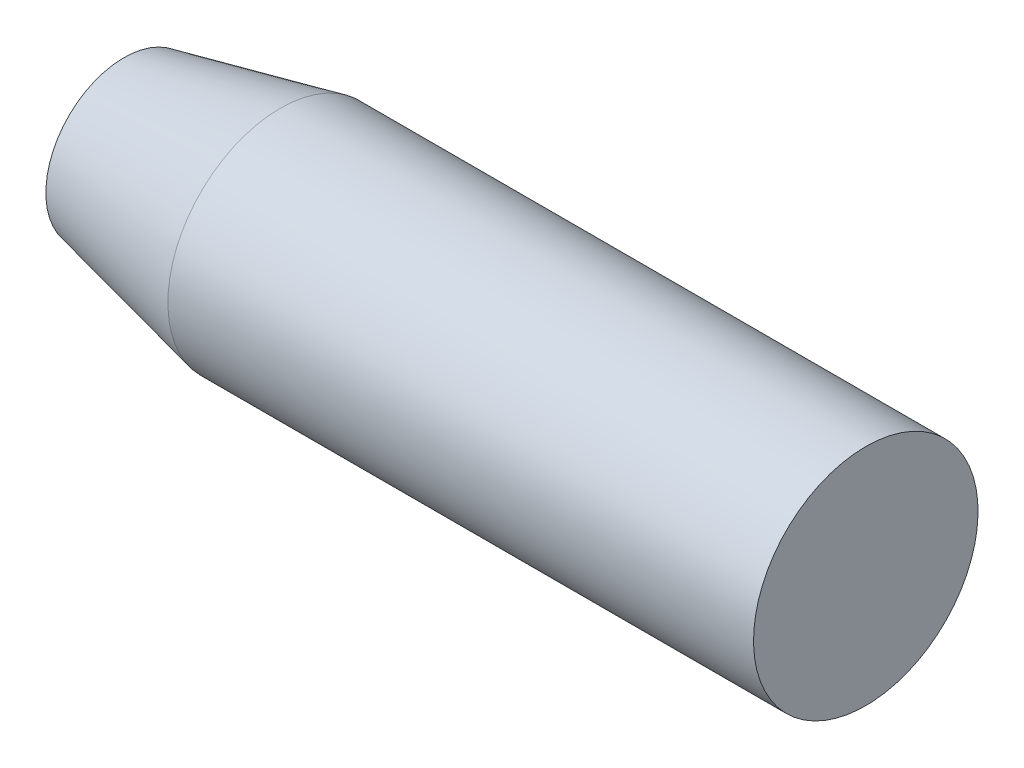
ISO-10303-21;
HEADER;
FILE_DESCRIPTION(('STEP AP214'),'2;1');
FILE_NAME('part.step','',(''),(''),'','','');
FILE_SCHEMA(('AUTOMOTIVE_DESIGN { 1 0 10303 214 1 1 1 1 }'));
ENDSEC;
DATA;
#1=APPLICATION_CONTEXT('core data for automotive mechanical design processes');
#2=APPLICATION_PROTOCOL_DEFINITION('international standard','automotive_design',2000,#1);
#3=PRODUCT_CONTEXT('',#1,'mechanical');
#4=PRODUCT('Part','Part','',(#3));
#5=PRODUCT_RELATED_PRODUCT_CATEGORY('part','',(#4));
#6=PRODUCT_DEFINITION_FORMATION('','',#4);
#7=PRODUCT_DEFINITION_CONTEXT('part definition',#1,'design');
#8=PRODUCT_DEFINITION('design','',#6,#7);
#9=PRODUCT_DEFINITION_SHAPE('','',#8);
#10=(LENGTH_UNIT() NAMED_UNIT(*) SI_UNIT(.MILLI.,.METRE.));
#11=(NAMED_UNIT(*) PLANE_ANGLE_UNIT() SI_UNIT($,.RADIAN.));
#12=(NAMED_UNIT(*) SI_UNIT($,.STERADIAN.) SOLID_ANGLE_UNIT());
#13=UNCERTAINTY_MEASURE_WITH_UNIT(LENGTH_MEASURE(1.E-05),#10,'distance_accuracy_value','');
#14=(GEOMETRIC_REPRESENTATION_CONTEXT(3) GLOBAL_UNCERTAINTY_ASSIGNED_CONTEXT((#13)) GLOBAL_UNIT_ASSIGNED_CONTEXT((#10,
#11,#12)) REPRESENTATION_CONTEXT('',''));
#15=CARTESIAN_POINT('',(0.,0.,0.));
#16=DIRECTION('',(0.,0.,1.));
#17=DIRECTION('',(1.,0.,0.));
#18=AXIS2_PLACEMENT_3D('',#15,#16,#17);
#19=CARTESIAN_POINT('',(-88.41436262106,9.59912506620378,0.));
#20=DIRECTION('',(-1.,0.,0.));
#21=DIRECTION('',(0.,0.,1.));
#22=AXIS2_PLACEMENT_3D('',#19,#20,#21);
#23=PLANE('',#22);
#24=CARTESIAN_POINT('',(-88.4143626210562,3.24912506620378,0.));
#25=DIRECTION('',(1.,0.,0.));
#26=DIRECTION('',(0.,0.,-1.));
#27=AXIS2_PLACEMENT_3D('',#24,#25,#26);
#28=CIRCLE('',#27,12.6999999999822);
#29=CARTESIAN_POINT('',(-88.4143626210562,3.24912506620378,-12.6999999999822));
#30=VERTEX_POINT('',#29);
#31=EDGE_CURVE('E18',#30,#30,#28,.T.);
#32=ORIENTED_EDGE('',*,*,#31,.F.);
#33=EDGE_LOOP('',(#32));
#34=FACE_BOUND('',#33,.T.);
#35=ADVANCED_FACE('F15',(#34),#23,.T.);
#36=CARTESIAN_POINT('',(-63.0143626210603,3.24912506620378,0.));
#37=DIRECTION('',(1.,0.,0.));
#38=DIRECTION('',(0.,0.,-1.));
#39=AXIS2_PLACEMENT_3D('',#36,#37,#38);
#40=CONICAL_SURFACE('',#39,18.2562499999999,0.215357699698438);
#41=CARTESIAN_POINT('',(-63.0143626210603,3.24912506620377,0.));
#42=DIRECTION('',(1.,0.,0.));
#43=DIRECTION('',(0.,1.,0.));
#44=AXIS2_PLACEMENT_3D('',#41,#42,#43);
#45=CIRCLE('',#44,18.25625);
#46=CARTESIAN_POINT('',(-63.0143626210603,21.5053750662038,0.));
#47=VERTEX_POINT('',#46);
#48=EDGE_CURVE('E22',#47,#47,#45,.T.);
#49=ORIENTED_EDGE('',*,*,#48,.F.);
#50=EDGE_LOOP('',(#49));
#51=FACE_BOUND('',#50,.T.);
#52=ORIENTED_EDGE('',*,*,#31,.T.);
#53=EDGE_LOOP('',(#52));
#54=FACE_BOUND('',#53,.T.);
#55=ADVANCED_FACE('F34',(#51,#54),#40,.T.);
#56=CARTESIAN_POINT('',(32.23563737894,12.3772500662038,0.));
#57=DIRECTION('',(1.,0.,0.));
#58=DIRECTION('',(0.,0.,-1.));
#59=AXIS2_PLACEMENT_3D('',#56,#57,#58);
#60=PLANE('',#59);
#61=CARTESIAN_POINT('',(32.23563737894,3.24912506620379,0.));
#62=DIRECTION('',(1.,0.,0.));
#63=DIRECTION('',(0.,1.,0.));
#64=AXIS2_PLACEMENT_3D('',#61,#62,#63);
#65=CIRCLE('',#64,18.25625);
#66=CARTESIAN_POINT('',(32.23563737894,21.5053750662038,0.));
#67=VERTEX_POINT('',#66);
#68=EDGE_CURVE('E10',#67,#67,#65,.F.);
#69=ORIENTED_EDGE('',*,*,#68,.F.);
#70=EDGE_LOOP('',(#69));
#71=FACE_BOUND('',#70,.T.);
#72=ADVANCED_FACE('F41',(#71),#60,.T.);
#73=CARTESIAN_POINT('',(-15.3893626210602,3.24912506620378,0.));
#74=DIRECTION('',(1.,0.,0.));
#75=DIRECTION('',(0.,1.,0.));
#76=AXIS2_PLACEMENT_3D('',#73,#74,#75);
#77=CYLINDRICAL_SURFACE('',#76,18.25625);
#78=ORIENTED_EDGE('',*,*,#68,.T.);
#79=EDGE_LOOP('',(#78));
#80=FACE_BOUND('',#79,.T.);
#81=ORIENTED_EDGE('',*,*,#48,.T.);
#82=EDGE_LOOP('',(#81));
#83=FACE_BOUND('',#82,.T.);
#84=ADVANCED_FACE('F43',(#80,#83),#77,.T.);
#85=CLOSED_SHELL('',(#35,#55,#72,#84));
#86=MANIFOLD_SOLID_BREP('B1',#85);
#87=ADVANCED_BREP_SHAPE_REPRESENTATION('',(#18,#86),#14);
#88=SHAPE_DEFINITION_REPRESENTATION(#9,#87);
ENDSEC;
END-ISO-10303-21;
